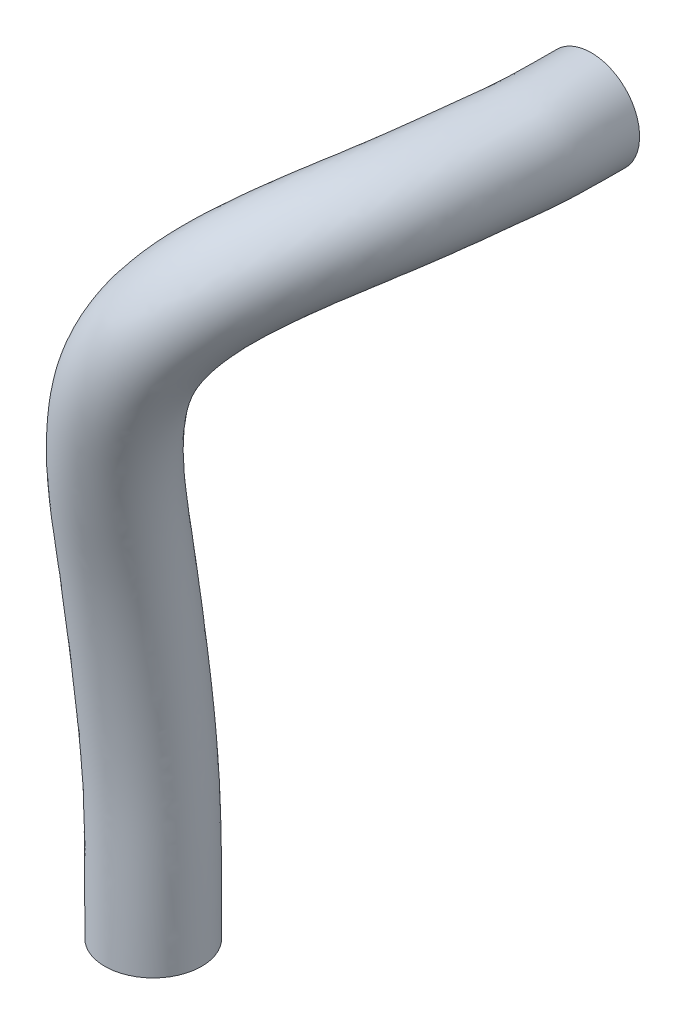
ISO-10303-21;
HEADER;
FILE_DESCRIPTION(('STEP AP214'),'2;1');
FILE_NAME('part.step','',(''),(''),'','','');
FILE_SCHEMA(('AUTOMOTIVE_DESIGN { 1 0 10303 214 1 1 1 1 }'));
ENDSEC;
DATA;
#1=APPLICATION_CONTEXT('core data for automotive mechanical design processes');
#2=APPLICATION_PROTOCOL_DEFINITION('international standard','automotive_design',2000,#1);
#3=PRODUCT_CONTEXT('',#1,'mechanical');
#4=PRODUCT('Part','Part','',(#3));
#5=PRODUCT_RELATED_PRODUCT_CATEGORY('part','',(#4));
#6=PRODUCT_DEFINITION_FORMATION('','',#4);
#7=PRODUCT_DEFINITION_CONTEXT('part definition',#1,'design');
#8=PRODUCT_DEFINITION('design','',#6,#7);
#9=PRODUCT_DEFINITION_SHAPE('','',#8);
#10=(LENGTH_UNIT() NAMED_UNIT(*) SI_UNIT(.MILLI.,.METRE.));
#11=(NAMED_UNIT(*) PLANE_ANGLE_UNIT() SI_UNIT($,.RADIAN.));
#12=(NAMED_UNIT(*) SI_UNIT($,.STERADIAN.) SOLID_ANGLE_UNIT());
#13=UNCERTAINTY_MEASURE_WITH_UNIT(LENGTH_MEASURE(1.E-05),#10,'distance_accuracy_value','');
#14=(GEOMETRIC_REPRESENTATION_CONTEXT(3) GLOBAL_UNCERTAINTY_ASSIGNED_CONTEXT((#13)) GLOBAL_UNIT_ASSIGNED_CONTEXT((#10,
#11,#12)) REPRESENTATION_CONTEXT('',''));
#15=CARTESIAN_POINT('',(0.,0.,0.));
#16=DIRECTION('',(0.,0.,1.));
#17=DIRECTION('',(1.,0.,0.));
#18=AXIS2_PLACEMENT_3D('',#15,#16,#17);
#19=CARTESIAN_POINT('',(-336.55,927.1,338.85632));
#20=DIRECTION('',(0.,0.,1.));
#21=DIRECTION('',(0.,-1.,0.));
#22=AXIS2_PLACEMENT_3D('',#19,#20,#21);
#23=PLANE('',#22);
#24=CARTESIAN_POINT('',(-336.55,927.1,338.85632));
#25=DIRECTION('',(0.,0.,1.));
#26=DIRECTION('',(-0.546944138603988,0.837169104331223,0.));
#27=AXIS2_PLACEMENT_3D('',#24,#25,#26);
#28=CIRCLE('',#27,9.525);
#29=CARTESIAN_POINT('',(-341.759642920203,935.074035718755,338.85632));
#30=VERTEX_POINT('',#29);
#31=EDGE_CURVE('E115',#30,#30,#28,.T.);
#32=ORIENTED_EDGE('',*,*,#31,.F.);
#33=EDGE_LOOP('',(#32));
#34=FACE_BOUND('',#33,.T.);
#35=ADVANCED_FACE('F107',(#34),#23,.F.);
#36=CARTESIAN_POINT('',(-370.740940000001,794.575499999998,390.834880000001));
#37=DIRECTION('',(0.,1.,0.));
#38=DIRECTION('',(-1.,0.,0.));
#39=AXIS2_PLACEMENT_3D('',#36,#37,#38);
#40=PLANE('',#39);
#41=CARTESIAN_POINT('',(-370.740940000001,794.575499999998,390.834880000001));
#42=DIRECTION('',(0.,1.,0.));
#43=DIRECTION('',(-1.,0.,0.));
#44=AXIS2_PLACEMENT_3D('',#41,#42,#43);
#45=CIRCLE('',#44,9.52499999999996);
#46=CARTESIAN_POINT('',(-380.265940000001,794.575499999998,390.834880000001));
#47=VERTEX_POINT('',#46);
#48=EDGE_CURVE('E12',#47,#47,#45,.T.);
#49=ORIENTED_EDGE('',*,*,#48,.F.);
#50=EDGE_LOOP('',(#49));
#51=FACE_BOUND('',#50,.T.);
#52=ADVANCED_FACE('F157',(#51),#40,.F.);
#53=CARTESIAN_POINT('',(-363.875846561985,794.575499999998,384.232144423945));
#54=CARTESIAN_POINT('',(-363.875846561985,813.538442573706,384.232144423945));
#55=CARTESIAN_POINT('',(-366.138362312185,826.256356056805,382.199412555187));
#56=CARTESIAN_POINT('',(-369.69591643495,858.842487553042,384.645385245826));
#57=CARTESIAN_POINT('',(-371.480098170451,877.29940631732,388.010628979993));
#58=CARTESIAN_POINT('',(-371.709992191479,888.548723611559,389.80921785998));
#59=CARTESIAN_POINT('',(-370.378401458642,898.584391741352,390.965969752315));
#60=CARTESIAN_POINT('',(-367.847305592848,906.254255456196,390.237681399423));
#61=CARTESIAN_POINT('',(-364.419205017656,912.394814490043,387.662215194741));
#62=CARTESIAN_POINT('',(-360.385878062156,917.409304545118,383.377363353419));
#63=CARTESIAN_POINT('',(-355.357931856773,922.311788270983,376.371534018735));
#64=CARTESIAN_POINT('',(-350.172464123541,926.31167970524,366.923123022771));
#65=CARTESIAN_POINT('',(-346.564536729796,928.818062136835,351.238681341508));
#66=CARTESIAN_POINT('',(-345.62926807341,929.979672941698,347.864913162774));
#67=CARTESIAN_POINT('',(-345.62926807341,929.979672941698,338.85632));
#68=CARTESIAN_POINT('',(-364.058054005534,794.575499999998,384.042697018297));
#69=CARTESIAN_POINT('',(-364.058054005534,813.537862419854,384.042697018297));
#70=CARTESIAN_POINT('',(-366.363127188615,826.247903824486,382.053235390905));
#71=CARTESIAN_POINT('',(-369.951726699931,858.852920394003,384.566283083457));
#72=CARTESIAN_POINT('',(-371.743791105873,877.320595746357,388.008796410978));
#73=CARTESIAN_POINT('',(-371.966912524196,888.591666463317,389.857965212192));
#74=CARTESIAN_POINT('',(-370.612943911095,898.669586123515,391.061019134472));
#75=CARTESIAN_POINT('',(-368.031191318342,906.408608865252,390.355071677878));
#76=CARTESIAN_POINT('',(-364.544254420937,912.601553616887,387.773155222408));
#77=CARTESIAN_POINT('',(-360.461067938123,917.643361270187,383.474703758758));
#78=CARTESIAN_POINT('',(-355.382540384418,922.56335182567,376.450799019607));
#79=CARTESIAN_POINT('',(-350.151378997116,926.568768899614,366.981785332704));
#80=CARTESIAN_POINT('',(-346.510486581572,929.075282653916,351.261972207635));
#81=CARTESIAN_POINT('',(-345.549801337401,930.23022215814,347.883080782822));
#82=CARTESIAN_POINT('',(-345.549801337401,930.23022215814,338.85632));
#83=CARTESIAN_POINT('',(-364.434421808428,794.575499999998,383.682159154465));
#84=CARTESIAN_POINT('',(-364.434421808428,813.536119928464,383.682159154465));
#85=CARTESIAN_POINT('',(-366.82024854612,826.231126278175,381.782023180023));
#86=CARTESIAN_POINT('',(-370.464974441655,858.869442744609,384.429900629229));
#87=CARTESIAN_POINT('',(-372.266685949965,877.358985120175,388.026321049975));
#88=CARTESIAN_POINT('',(-372.472469762987,888.673687679927,389.975484845965));
#89=CARTESIAN_POINT('',(-371.070628282055,898.835987628655,391.269530733739));
#90=CARTESIAN_POINT('',(-368.384377772455,906.714301121905,390.606045638701));
#91=CARTESIAN_POINT('',(-364.777599938832,913.011612309155,388.008833368495));
#92=CARTESIAN_POINT('',(-360.593342121025,918.106996622751,383.680977860107));
#93=CARTESIAN_POINT('',(-355.412592230783,923.060461390856,376.618280260233));
#94=CARTESIAN_POINT('',(-350.089457434256,927.075123135329,367.105085261648));
#95=CARTESIAN_POINT('',(-346.382579391239,929.580360761805,351.310256628765));
#96=CARTESIAN_POINT('',(-345.372021429152,930.720155396994,347.921270822749));
#97=CARTESIAN_POINT('',(-345.372021429152,930.720155396994,338.85632));
#98=CARTESIAN_POINT('',(-365.031354984848,794.575499999998,383.196490939611));
#99=CARTESIAN_POINT('',(-365.031354984848,813.531873335022,383.196490939611));
#100=CARTESIAN_POINT('',(-367.525240286871,826.206404213179,381.437879334616));
#101=CARTESIAN_POINT('',(-371.236592155603,858.881578124354,384.289189342849));
#102=CARTESIAN_POINT('',(-373.035033838916,877.404816067998,388.113756514145));
#103=CARTESIAN_POINT('',(-373.203949137237,888.785076574111,390.208969558425));
#104=CARTESIAN_POINT('',(-371.721564141917,899.073105799284,391.634319459294));
#105=CARTESIAN_POINT('',(-368.869964131036,907.162364428834,391.027867465166));
#106=CARTESIAN_POINT('',(-365.077847938164,913.614453235256,388.400877503142));
#107=CARTESIAN_POINT('',(-360.73865670793,918.786834105995,384.022706368991));
#108=CARTESIAN_POINT('',(-355.402099418277,923.785867509577,376.89443410735));
#109=CARTESIAN_POINT('',(-349.939840331327,927.809120952182,367.306432259345));
#110=CARTESIAN_POINT('',(-346.134203396842,930.308003885195,351.387927792681));
#111=CARTESIAN_POINT('',(-345.051899951753,931.419958992111,347.982403617648));
#112=CARTESIAN_POINT('',(-345.051899951753,931.419958992111,338.85632));
#113=CARTESIAN_POINT('',(-365.657192358042,794.575499999998,382.766029044149));
#114=CARTESIAN_POINT('',(-365.657192358042,813.526031482316,382.766029044149));
#115=CARTESIAN_POINT('',(-368.246076622668,826.182226656584,381.155658073333));
#116=CARTESIAN_POINT('',(-372.006820436989,858.881444263218,384.210737246571));
#117=CARTESIAN_POINT('',(-373.784866053743,877.439109672116,388.259919645498));
#118=CARTESIAN_POINT('',(-373.90656582354,888.88477295158,390.496790056915));
#119=CARTESIAN_POINT('',(-372.335520210457,899.297217595793,392.047912164825));
#120=CARTESIAN_POINT('',(-369.310918835063,907.598521258773,391.491831305533));
#121=CARTESIAN_POINT('',(-365.328815248478,914.203058622428,388.828579484841));
#122=CARTESIAN_POINT('',(-360.832094627035,919.448874790387,384.394296117809));
#123=CARTESIAN_POINT('',(-355.337961068441,924.488809802945,377.193566559575));
#124=CARTESIAN_POINT('',(-349.736007641154,928.515524154634,367.522870604127));
#125=CARTESIAN_POINT('',(-345.832217666308,931.003787710536,351.470163262456));
#126=CARTESIAN_POINT('',(-344.68141455299,932.083065642986,348.047424987782));
#127=CARTESIAN_POINT('',(-344.68141455299,932.083065642985,338.85632));
#128=CARTESIAN_POINT('',(-369.564778125994,794.575499999998,380.514902018718));
#129=CARTESIAN_POINT('',(-369.564778125994,813.482290250557,380.514902018718));
#130=CARTESIAN_POINT('',(-372.645371551035,826.040713117918,379.829354702361));
#131=CARTESIAN_POINT('',(-376.601040326375,858.809324443137,384.103960548407));
#132=CARTESIAN_POINT('',(-378.157637516346,877.576938149568,389.474739441434));
#133=CARTESIAN_POINT('',(-377.937052589636,889.412499599709,392.532510771739));
#134=CARTESIAN_POINT('',(-375.78904330532,900.56071621406,394.802988657292));
#135=CARTESIAN_POINT('',(-371.6862271401,910.135435028173,394.509151961737));
#136=CARTESIAN_POINT('',(-366.541872507211,917.637347139953,391.591528715125));
#137=CARTESIAN_POINT('',(-361.08878225274,923.301250587326,386.788247898252));
#138=CARTESIAN_POINT('',(-354.642808013765,928.558447031598,379.114598941094));
#139=CARTESIAN_POINT('',(-348.20283300503,932.576009217403,368.903605822046));
#140=CARTESIAN_POINT('',(-343.716077702829,934.976023316482,351.989108005759));
#141=CARTESIAN_POINT('',(-342.174844794205,935.831919796307,348.456336278682));
#142=CARTESIAN_POINT('',(-342.174844794205,935.831919796307,338.85632));
#143=CARTESIAN_POINT('',(-374.312517085685,794.575499999998,381.054467465203));
#144=CARTESIAN_POINT('',(-374.312517085685,813.36159572278,381.054467465203));
#145=CARTESIAN_POINT('',(-377.229636990176,825.945924946403,381.486907579647));
#146=CARTESIAN_POINT('',(-380.571045007538,858.186505594578,386.847491427096));
#147=CARTESIAN_POINT('',(-381.152753989246,877.172214659308,393.217577832733));
#148=CARTESIAN_POINT('',(-380.160139635345,889.342932364181,396.795883203128));
#149=CARTESIAN_POINT('',(-377.135694597243,901.077234949235,399.445793371735));
#150=CARTESIAN_POINT('',(-371.737589865534,911.820021977526,399.078597475538));
#151=CARTESIAN_POINT('',(-365.361014866409,920.003611741215,395.642120798302));
#152=CARTESIAN_POINT('',(-358.950011848404,925.872265602279,390.250885425493));
#153=CARTESIAN_POINT('',(-351.587793833282,931.107513286744,381.847669906229));
#154=CARTESIAN_POINT('',(-344.386130796415,934.883220694864,370.80779048718));
#155=CARTESIAN_POINT('',(-339.41519265577,937.011409636437,352.637037806356));
#156=CARTESIAN_POINT('',(-337.679114521366,937.450735849564,349.026240086154));
#157=CARTESIAN_POINT('',(-337.679114521366,937.450735849564,338.85632));
#158=CARTESIAN_POINT('',(-381.132623689022,794.575499999998,387.613935432965));
#159=CARTESIAN_POINT('',(-381.132623689022,813.124578198296,387.613935432965));
#160=CARTESIAN_POINT('',(-382.470865213249,825.919150358351,389.642329682964));
#161=CARTESIAN_POINT('',(-383.426525594906,856.348623966856,395.863859679348));
#162=CARTESIAN_POINT('',(-381.361047758013,875.579815078495,402.598242488059));
#163=CARTESIAN_POINT('',(-378.630314808589,887.98761000808,406.081956348399));
#164=CARTESIAN_POINT('',(-374.037011063813,900.019883863118,408.403309826532));
#165=CARTESIAN_POINT('',(-366.804281515544,911.770910798425,407.238257092085));
#166=CARTESIAN_POINT('',(-358.975437925259,920.211910083613,402.68613915796));
#167=CARTESIAN_POINT('',(-351.548884833669,925.839070201553,396.20270836631));
#168=CARTESIAN_POINT('',(-343.294857734148,930.537738041593,386.482327075578));
#169=CARTESIAN_POINT('',(-335.452134385136,933.558455166372,373.916498554909));
#170=CARTESIAN_POINT('',(-330.181558343262,935.005418252406,353.696948024706));
#171=CARTESIAN_POINT('',(-328.659342729471,934.589933353217,349.76220375899));
#172=CARTESIAN_POINT('',(-328.659342729471,934.589933353217,338.85632));
#173=CARTESIAN_POINT('',(-381.250182308995,794.575499999998,393.648667463092));
#174=CARTESIAN_POINT('',(-381.250182308995,813.005798245306,393.648667463092));
#175=CARTESIAN_POINT('',(-381.185260739137,826.054602341449,395.694302824063));
#176=CARTESIAN_POINT('',(-380.560753591174,855.349438318369,401.215027058618));
#177=CARTESIAN_POINT('',(-377.173292314035,874.51763570029,406.859059523113));
#178=CARTESIAN_POINT('',(-373.768567109948,886.678989089691,409.478820768807));
#179=CARTESIAN_POINT('',(-368.831004325033,898.159641167923,410.900148710048));
#180=CARTESIAN_POINT('',(-361.593321156945,909.242450349343,409.012486555412));
#181=CARTESIAN_POINT('',(-354.064798026788,916.948942481872,404.06184940538));
#182=CARTESIAN_POINT('',(-346.989782820902,922.023610104051,397.306824674329));
#183=CARTESIAN_POINT('',(-339.15482636569,926.19599227147,387.284874582197));
#184=CARTESIAN_POINT('',(-331.764907793782,928.786455644934,374.371824869641));
#185=CARTESIAN_POINT('',(-326.894451214371,929.924025851884,353.775958138573));
#186=CARTESIAN_POINT('',(-325.881397206397,929.231311387132,349.844064515517));
#187=CARTESIAN_POINT('',(-325.881397206397,929.231311387132,338.85632));
#188=CARTESIAN_POINT('',(-373.961884567037,794.575499999998,401.226563689023));
#189=CARTESIAN_POINT('',(-373.961884567037,813.026719882371,401.226563689023));
#190=CARTESIAN_POINT('',(-372.194665681962,826.393795034752,401.541389200811));
#191=CARTESIAN_POINT('',(-370.328342991951,854.932036343498,404.379114041235));
#192=CARTESIAN_POINT('',(-366.625574897167,873.670071427552,406.932361738691));
#193=CARTESIAN_POINT('',(-363.491753801277,884.96127153782,407.528928784168));
#194=CARTESIAN_POINT('',(-359.449306226913,894.751866556625,407.098166402533));
#195=CARTESIAN_POINT('',(-354.237892137197,903.068313829128,404.316894388268));
#196=CARTESIAN_POINT('',(-349.062821895549,908.679377450405,399.624176956149));
#197=CARTESIAN_POINT('',(-343.982187782223,912.661341090177,393.413475130364));
#198=CARTESIAN_POINT('',(-338.170485259897,916.133450089597,384.112955391832));
#199=CARTESIAN_POINT('',(-332.608312850776,918.502887868117,372.034629561666));
#200=CARTESIAN_POINT('',(-329.056457143339,919.635205169173,352.810284838813));
#201=CARTESIAN_POINT('',(-329.060066646782,919.209342729471,349.190610214642));
#202=CARTESIAN_POINT('',(-329.060066646782,919.209342729471,338.85632));
#203=CARTESIAN_POINT('',(-367.92715253691,794.575499999998,401.344122308995));
#204=CARTESIAN_POINT('',(-367.92715253691,813.166421472426,401.344122308995));
#205=CARTESIAN_POINT('',(-366.181047224012,826.531823486207,400.236508952955));
#206=CARTESIAN_POINT('',(-364.886695339793,855.592496718453,401.596783179977));
#207=CARTESIAN_POINT('',(-362.249921538892,874.044113905074,402.73105772068));
#208=CARTESIAN_POINT('',(-360.010032475441,884.875329656117,402.548995841307));
#209=CARTESIAN_POINT('',(-357.038563966991,893.845427303575,401.514611864484));
#210=CARTESIAN_POINT('',(-353.477177002163,900.58415874608,398.730407777157));
#211=CARTESIAN_POINT('',(-349.912491563399,905.228506981696,394.645759228966));
#212=CARTESIAN_POINT('',(-346.099504069232,908.875826160396,389.148005239344));
#213=CARTESIAN_POINT('',(-341.511356491936,912.305687805059,380.73742565515));
#214=CARTESIAN_POINT('',(-336.980277381485,914.925934596786,369.666194284054));
#215=CARTESIAN_POINT('',(-334.098838884824,916.363380079448,352.004395680175));
#216=CARTESIAN_POINT('',(-334.418688612868,916.431397206397,348.455295157239));
#217=CARTESIAN_POINT('',(-334.418688612868,916.431397206397,338.85632));
#218=CARTESIAN_POINT('',(-361.107045933572,794.575499999998,394.784654341234));
#219=CARTESIAN_POINT('',(-361.107045933572,813.404395563793,394.784654341234));
#220=CARTESIAN_POINT('',(-360.939819000939,826.55813606132,392.081086932242));
#221=CARTESIAN_POINT('',(-362.031214752425,857.430415334177,392.580414720557));
#222=CARTESIAN_POINT('',(-362.041627770125,875.636508089136,393.350393296807));
#223=CARTESIAN_POINT('',(-361.539857302196,886.230653470008,393.262921802639));
#224=CARTESIAN_POINT('',(-360.13724750042,894.902778106974,392.557098391253));
#225=CARTESIAN_POINT('',(-358.410485352154,900.633269991338,390.57074010458));
#226=CARTESIAN_POINT('',(-356.298068504549,905.020208621593,387.601771164787));
#227=CARTESIAN_POINT('',(-353.500631083967,908.909021565777,383.196069057776));
#228=CARTESIAN_POINT('',(-349.80429259107,912.875463047857,376.10332866269));
#229=CARTESIAN_POINT('',(-345.914273792764,916.250700126054,366.55353822487));
#230=CARTESIAN_POINT('',(-343.332473197332,918.369371463258,350.958939912337));
#231=CARTESIAN_POINT('',(-343.438460404763,919.292199702744,347.688225797249));
#232=CARTESIAN_POINT('',(-343.438460404763,919.292199702744,338.85632));
#233=CARTESIAN_POINT('',(-360.382984892787,794.575499999998,390.06153125268));
#234=CARTESIAN_POINT('',(-360.382984892787,813.511676460216,390.06153125268));
#235=CARTESIAN_POINT('',(-361.3190251556,826.466564826342,387.195510957764));
#236=CARTESIAN_POINT('',(-363.710255437267,858.283598808538,388.090074833526));
#237=CARTESIAN_POINT('',(-364.869629282757,876.509160084622,389.567086250656));
#238=CARTESIAN_POINT('',(-364.990329193132,887.248524648719,390.076035207131));
#239=CARTESIAN_POINT('',(-363.969985527615,896.267602856295,390.013262856223));
#240=CARTESIAN_POINT('',(-362.419861962389,902.357261660067,388.593622603647));
#241=CARTESIAN_POINT('',(-360.240385902173,907.219353893187,386.001045919005));
#242=CARTESIAN_POINT('',(-357.299815781818,911.506669573333,381.883055712337));
#243=CARTESIAN_POINT('',(-353.402735664318,915.881662267881,375.120361764354));
#244=CARTESIAN_POINT('',(-349.265354202617,919.620776548335,365.946911861757));
#245=CARTESIAN_POINT('',(-346.439771507827,922.014173036482,350.817574145119));
#246=CARTESIAN_POINT('',(-346.179330696355,923.206249542114,347.536231080292));
#247=CARTESIAN_POINT('',(-346.179330696355,923.206249542114,338.85632));
#248=CARTESIAN_POINT('',(-362.480219602963,794.575499999998,386.069237928166));
#249=CARTESIAN_POINT('',(-362.480219602963,813.536203478253,386.069237928166));
#250=CARTESIAN_POINT('',(-364.327071587492,826.329572703152,383.704406138388));
#251=CARTESIAN_POINT('',(-367.546507364793,858.699539214072,385.589964174389));
#252=CARTESIAN_POINT('',(-369.187110576665,877.069650030748,388.291872369779));
#253=CARTESIAN_POINT('',(-369.426897587332,888.13602058595,389.646830165066));
#254=CARTESIAN_POINT('',(-368.246033157463,897.8117665693,390.390629338877));
#255=CARTESIAN_POINT('',(-366.104683521276,904.907212029247,389.445011528973));
#256=CARTESIAN_POINT('',(-363.148451265951,910.598350928884,386.894228570713));
#257=CARTESIAN_POINT('',(-359.521082394208,915.367856890384,382.697060429837));
#258=CARTESIAN_POINT('',(-354.908886271345,920.102542459136,375.811531859606));
#259=CARTESIAN_POINT('',(-350.103648341689,924.032911643121,366.499811385386));
#260=CARTESIAN_POINT('',(-346.774637168891,926.518885453529,351.064875916054));
#261=CARTESIAN_POINT('',(-346.066998205997,927.714484321952,347.728905123714));
#262=CARTESIAN_POINT('',(-346.066998205997,927.714484321952,338.85632));
#263=CARTESIAN_POINT('',(-362.885981118194,794.575499999998,385.427110640249));
#264=CARTESIAN_POINT('',(-362.885981118194,813.538740749698,385.427110640249));
#265=CARTESIAN_POINT('',(-364.878780391265,826.305906118604,383.159020154081));
#266=CARTESIAN_POINT('',(-368.224593048313,858.758739633855,385.220565730417));
#267=CARTESIAN_POINT('',(-369.930221425898,877.155324148661,388.135333828124));
#268=CARTESIAN_POINT('',(-370.178879706006,888.279452544729,389.635001231851));
#269=CARTESIAN_POINT('',(-368.959979662639,898.069997476804,390.515175056282));
#270=CARTESIAN_POINT('',(-366.704829588555,905.344953662804,389.645673168269));
#271=CARTESIAN_POINT('',(-363.605472734306,911.180234789348,387.094632108124));
#272=CARTESIAN_POINT('',(-359.853344934742,916.030968750196,382.876582407466));
#273=CARTESIAN_POINT('',(-355.112350047573,920.823870647468,375.961160898956));
#274=CARTESIAN_POINT('',(-350.188103949573,924.782063285046,366.615577294813));
#275=CARTESIAN_POINT('',(-346.77060865686,927.279399978758,351.114222098976));
#276=CARTESIAN_POINT('',(-345.987568963857,928.469905301687,347.767353183556));
#277=CARTESIAN_POINT('',(-345.987568963857,928.469905301687,338.85632));
#278=CARTESIAN_POINT('',(-363.348032768793,794.575499999998,384.811715560475));
#279=CARTESIAN_POINT('',(-363.348032768793,813.539600851579,384.811715560475));
#280=CARTESIAN_POINT('',(-365.480116148169,826.281511110794,382.653586198295));
#281=CARTESIAN_POINT('',(-368.939737806488,858.807239082352,384.90153735112));
#282=CARTESIAN_POINT('',(-370.694449880508,877.232645682809,388.037247518076));
#283=CARTESIAN_POINT('',(-370.940614488107,888.417646343139,389.684834850003));
#284=CARTESIAN_POINT('',(-369.672198312834,898.328026798996,390.702810774066));
#285=CARTESIAN_POINT('',(-367.287982187123,905.793988272513,389.906120643065));
#286=CARTESIAN_POINT('',(-364.032008548649,911.778956182897,387.34736802734));
#287=CARTESIAN_POINT('',(-360.145031911788,916.71146274227,383.100595407874));
#288=CARTESIAN_POINT('',(-355.265866969761,921.560545233368,376.145684939803));
#289=CARTESIAN_POINT('',(-350.215174857216,925.542261044004,366.755231833776));
#290=CARTESIAN_POINT('',(-346.704846624002,928.046715675281,351.171705403273));
#291=CARTESIAN_POINT('',(-345.845831880223,929.226287104187,347.812265102457));
#292=CARTESIAN_POINT('',(-345.845831880223,929.226287104187,338.85632));
#293=CARTESIAN_POINT('',(-363.693639118436,794.575499999998,384.421591829593));
#294=CARTESIAN_POINT('',(-363.693639118436,813.539022727558,384.421591829593));
#295=CARTESIAN_POINT('',(-365.913597435756,826.264808289124,382.345589719469));
#296=CARTESIAN_POINT('',(-369.44010616997,858.832054712082,384.724487408195));
#297=CARTESIAN_POINT('',(-371.216405235029,877.278216888282,388.012461549009));
#298=CARTESIAN_POINT('',(-371.453071858762,888.505780759801,389.760470507767));
#299=CARTESIAN_POINT('',(-370.143859006189,898.49919735919,390.870920370159));
#300=CARTESIAN_POINT('',(-367.663419867354,906.099902047141,390.120291120967));
#301=CARTESIAN_POINT('',(-364.294155614375,912.1880753632,387.551275167074));
#302=CARTESIAN_POINT('',(-360.310688186189,917.175247820049,383.280022948079));
#303=CARTESIAN_POINT('',(-355.333323329128,922.060224716296,376.292269017863));
#304=CARTESIAN_POINT('',(-350.193549249966,926.054590510866,366.864460712838));
#305=CARTESIAN_POINT('',(-346.618586878021,928.560841619754,351.21539047538));
#306=CARTESIAN_POINT('',(-345.70873480942,929.729123725257,347.846745542725));
#307=CARTESIAN_POINT('',(-345.70873480942,929.729123725257,338.85632));
#308=CARTESIAN_POINT('',(-363.875846561985,794.575499999998,384.232144423945));
#309=CARTESIAN_POINT('',(-363.875846561985,813.538442573706,384.232144423945));
#310=CARTESIAN_POINT('',(-366.138362312185,826.256356056805,382.199412555187));
#311=CARTESIAN_POINT('',(-369.69591643495,858.842487553042,384.645385245826));
#312=CARTESIAN_POINT('',(-371.480098170451,877.29940631732,388.010628979993));
#313=CARTESIAN_POINT('',(-371.709992191479,888.548723611559,389.80921785998));
#314=CARTESIAN_POINT('',(-370.378401458642,898.584391741352,390.965969752315));
#315=CARTESIAN_POINT('',(-367.847305592848,906.254255456196,390.237681399423));
#316=CARTESIAN_POINT('',(-364.419205017656,912.394814490043,387.662215194741));
#317=CARTESIAN_POINT('',(-360.385878062156,917.409304545118,383.377363353419));
#318=CARTESIAN_POINT('',(-355.357931856773,922.311788270983,376.371534018735));
#319=CARTESIAN_POINT('',(-350.172464123541,926.31167970524,366.923123022771));
#320=CARTESIAN_POINT('',(-346.564536729796,928.818062136835,351.238681341508));
#321=CARTESIAN_POINT('',(-345.62926807341,929.979672941698,347.864913162774));
#322=CARTESIAN_POINT('',(-345.62926807341,929.979672941698,338.85632));
#323=B_SPLINE_SURFACE_WITH_KNOTS('',3,3,((#53,#54,#55,#56,#57,#58,#59,#60,#61,#62,#63,#64,#65,
#66,#67),(#68,#69,#70,#71,#72,#73,#74,#75,#76,#77,#78,#79,#80,#81,#82),(#83,#84,#85,#86,#87,#88,
#89,#90,#91,#92,#93,#94,#95,#96,#97),(#98,#99,#100,#101,#102,#103,#104,#105,#106,#107,#108,#109,
#110,#111,#112),(#113,#114,#115,#116,#117,#118,#119,#120,#121,#122,#123,#124,#125,#126,#127),
(#128,#129,#130,#131,#132,#133,#134,#135,#136,#137,#138,#139,#140,#141,#142),(#143,#144,#145,
#146,#147,#148,#149,#150,#151,#152,#153,#154,#155,#156,#157),(#158,#159,#160,#161,#162,#163,
#164,#165,#166,#167,#168,#169,#170,#171,#172),(#173,#174,#175,#176,#177,#178,#179,#180,#181,
#182,#183,#184,#185,#186,#187),(#188,#189,#190,#191,#192,#193,#194,#195,#196,#197,#198,#199,
#200,#201,#202),(#203,#204,#205,#206,#207,#208,#209,#210,#211,#212,#213,#214,#215,#216,#217),
(#218,#219,#220,#221,#222,#223,#224,#225,#226,#227,#228,#229,#230,#231,#232),(#233,#234,#235,
#236,#237,#238,#239,#240,#241,#242,#243,#244,#245,#246,#247),(#248,#249,#250,#251,#252,#253,
#254,#255,#256,#257,#258,#259,#260,#261,#262),(#263,#264,#265,#266,#267,#268,#269,#270,#271,
#272,#273,#274,#275,#276,#277),(#278,#279,#280,#281,#282,#283,#284,#285,#286,#287,#288,#289,
#290,#291,#292),(#293,#294,#295,#296,#297,#298,#299,#300,#301,#302,#303,#304,#305,#306,#307),
(#308,#309,#310,#311,#312,#313,#314,#315,#316,#317,#318,#319,#320,#321,#322)),.UNSPECIFIED.,.T.,
.F.,.F.,(4,1,1,1,1,2,2,2,1,1,1,1,4),(4,1,1,1,1,1,1,1,1,1,1,1,4),(0.,0.0125,0.0249999999999999,
0.0375000000000001,0.05,0.25,0.5,0.75,0.95,0.9625,0.975,0.9875,1.),(0.,0.187159597009203,
0.374719580725823,0.437544713039973,0.500412754658069,0.563181422785825,0.610155434803567,
0.657027215976701,0.703943425246381,0.750830976129429,0.83392592590811,0.916953261768221,1.),.UNSPECIFIED.);
#324=ORIENTED_EDGE('',*,*,#48,.T.);
#325=EDGE_LOOP('',(#324));
#326=FACE_BOUND('',#325,.T.);
#327=ORIENTED_EDGE('',*,*,#31,.T.);
#328=EDGE_LOOP('',(#327));
#329=FACE_BOUND('',#328,.T.);
#330=ADVANCED_FACE('F141',(#326,#329),#323,.T.);
#331=CLOSED_SHELL('',(#35,#52,#330));
#332=MANIFOLD_SOLID_BREP('B2',#331);
#333=ADVANCED_BREP_SHAPE_REPRESENTATION('',(#18,#332),#14);
#334=SHAPE_DEFINITION_REPRESENTATION(#9,#333);
ENDSEC;
END-ISO-10303-21;
